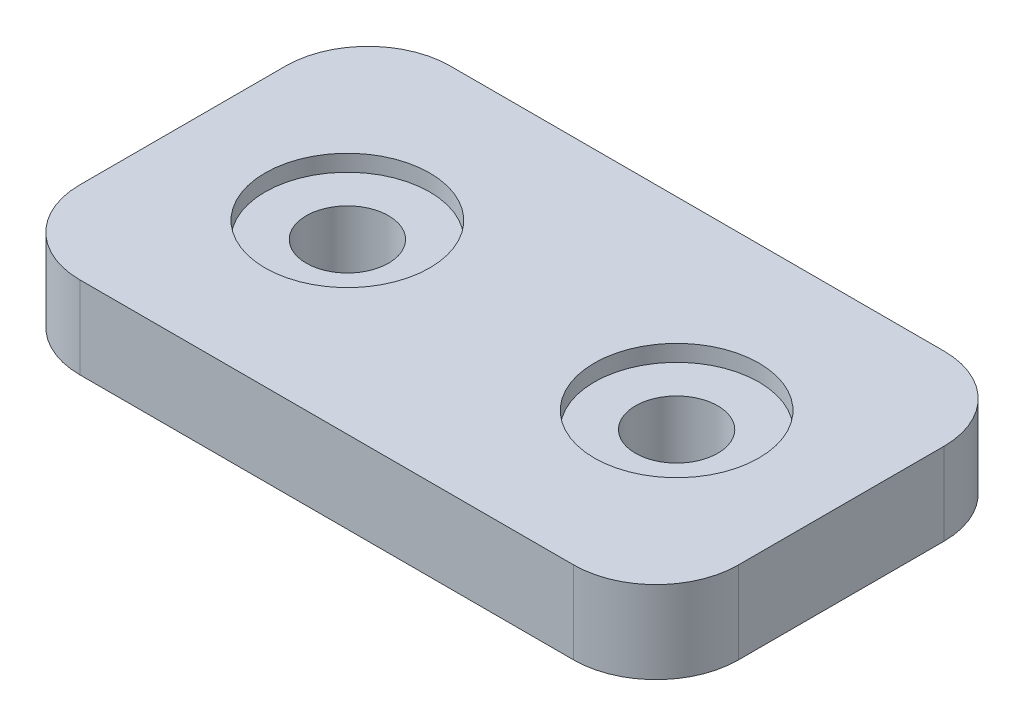
ISO-10303-21;
HEADER;
FILE_DESCRIPTION(('STEP AP214'),'2;1');
FILE_NAME('part.step','',(''),(''),'','','');
FILE_SCHEMA(('AUTOMOTIVE_DESIGN { 1 0 10303 214 1 1 1 1 }'));
ENDSEC;
DATA;
#1=APPLICATION_CONTEXT('core data for automotive mechanical design processes');
#2=APPLICATION_PROTOCOL_DEFINITION('international standard','automotive_design',2000,#1);
#3=PRODUCT_CONTEXT('',#1,'mechanical');
#4=PRODUCT('Part','Part','',(#3));
#5=PRODUCT_RELATED_PRODUCT_CATEGORY('part','',(#4));
#6=PRODUCT_DEFINITION_FORMATION('','',#4);
#7=PRODUCT_DEFINITION_CONTEXT('part definition',#1,'design');
#8=PRODUCT_DEFINITION('design','',#6,#7);
#9=PRODUCT_DEFINITION_SHAPE('','',#8);
#10=(LENGTH_UNIT() NAMED_UNIT(*) SI_UNIT(.MILLI.,.METRE.));
#11=(NAMED_UNIT(*) PLANE_ANGLE_UNIT() SI_UNIT($,.RADIAN.));
#12=(NAMED_UNIT(*) SI_UNIT($,.STERADIAN.) SOLID_ANGLE_UNIT());
#13=UNCERTAINTY_MEASURE_WITH_UNIT(LENGTH_MEASURE(1.E-05),#10,'distance_accuracy_value','');
#14=(GEOMETRIC_REPRESENTATION_CONTEXT(3) GLOBAL_UNCERTAINTY_ASSIGNED_CONTEXT((#13)) GLOBAL_UNIT_ASSIGNED_CONTEXT((#10,
#11,#12)) REPRESENTATION_CONTEXT('',''));
#15=CARTESIAN_POINT('',(0.,0.,0.));
#16=DIRECTION('',(0.,0.,1.));
#17=DIRECTION('',(1.,0.,0.));
#18=AXIS2_PLACEMENT_3D('',#15,#16,#17);
#19=CARTESIAN_POINT('',(0.,12.7,0.));
#20=DIRECTION('',(0.,1.,0.));
#21=DIRECTION('',(0.,0.,1.));
#22=AXIS2_PLACEMENT_3D('',#19,#20,#21);
#23=PLANE('',#22);
#24=DIRECTION('',(0.,0.,-1.));
#25=VECTOR('',#24,1.);
#26=CARTESIAN_POINT('',(50.8,12.7,28.575));
#27=LINE('',#26,#25);
#28=CARTESIAN_POINT('',(50.8,12.7,15.875));
#29=VERTEX_POINT('',#28);
#30=CARTESIAN_POINT('',(50.8,12.7,-15.875));
#31=VERTEX_POINT('',#30);
#32=EDGE_CURVE('E207',#29,#31,#27,.T.);
#33=ORIENTED_EDGE('',*,*,#32,.T.);
#34=CARTESIAN_POINT('',(38.1,12.7,-15.875));
#35=DIRECTION('',(0.,1.,0.));
#36=DIRECTION('',(0.,0.,1.));
#37=AXIS2_PLACEMENT_3D('',#34,#35,#36);
#38=CIRCLE('',#37,12.7);
#39=CARTESIAN_POINT('',(38.1,12.7,-28.575));
#40=VERTEX_POINT('',#39);
#41=EDGE_CURVE('E168',#31,#40,#38,.T.);
#42=ORIENTED_EDGE('',*,*,#41,.T.);
#43=DIRECTION('',(1.,0.,0.));
#44=VECTOR('',#43,1.);
#45=CARTESIAN_POINT('',(-50.8,12.7,-28.575));
#46=LINE('',#45,#44);
#47=CARTESIAN_POINT('',(-38.1,12.7,-28.575));
#48=VERTEX_POINT('',#47);
#49=EDGE_CURVE('E143',#48,#40,#46,.T.);
#50=ORIENTED_EDGE('',*,*,#49,.F.);
#51=CARTESIAN_POINT('',(-38.1,12.7,-15.875));
#52=DIRECTION('',(0.,1.,0.));
#53=DIRECTION('',(0.,0.,1.));
#54=AXIS2_PLACEMENT_3D('',#51,#52,#53);
#55=CIRCLE('',#54,12.7);
#56=CARTESIAN_POINT('',(-50.8,12.7,-15.875));
#57=VERTEX_POINT('',#56);
#58=EDGE_CURVE('E59',#48,#57,#55,.T.);
#59=ORIENTED_EDGE('',*,*,#58,.T.);
#60=DIRECTION('',(0.,0.,-1.));
#61=VECTOR('',#60,1.);
#62=CARTESIAN_POINT('',(-50.8,12.7,28.575));
#63=LINE('',#62,#61);
#64=CARTESIAN_POINT('',(-50.8,12.7,15.875));
#65=VERTEX_POINT('',#64);
#66=EDGE_CURVE('E135',#65,#57,#63,.T.);
#67=ORIENTED_EDGE('',*,*,#66,.F.);
#68=CARTESIAN_POINT('',(-38.1,12.7,15.875));
#69=DIRECTION('',(0.,1.,0.));
#70=DIRECTION('',(0.,0.,1.));
#71=AXIS2_PLACEMENT_3D('',#68,#69,#70);
#72=CIRCLE('',#71,12.7);
#73=CARTESIAN_POINT('',(-38.1,12.7,28.575));
#74=VERTEX_POINT('',#73);
#75=EDGE_CURVE('E160',#65,#74,#72,.T.);
#76=ORIENTED_EDGE('',*,*,#75,.T.);
#77=DIRECTION('',(1.,0.,0.));
#78=VECTOR('',#77,1.);
#79=CARTESIAN_POINT('',(-50.8,12.7,28.575));
#80=LINE('',#79,#78);
#81=CARTESIAN_POINT('',(38.1,12.7,28.575));
#82=VERTEX_POINT('',#81);
#83=EDGE_CURVE('E188',#74,#82,#80,.T.);
#84=ORIENTED_EDGE('',*,*,#83,.T.);
#85=CARTESIAN_POINT('',(38.1,12.7,15.875));
#86=DIRECTION('',(0.,1.,0.));
#87=DIRECTION('',(0.,0.,1.));
#88=AXIS2_PLACEMENT_3D('',#85,#86,#87);
#89=CIRCLE('',#88,12.7);
#90=EDGE_CURVE('E163',#82,#29,#89,.T.);
#91=ORIENTED_EDGE('',*,*,#90,.T.);
#92=EDGE_LOOP('',(#33,#42,#50,#59,#67,#76,#84,#91));
#93=FACE_BOUND('',#92,.T.);
#94=CARTESIAN_POINT('',(25.4,12.7,0.));
#95=DIRECTION('',(0.,1.,0.));
#96=DIRECTION('',(0.,0.,1.));
#97=AXIS2_PLACEMENT_3D('',#94,#95,#96);
#98=CIRCLE('',#97,12.7);
#99=CARTESIAN_POINT('',(25.4,12.7,12.7));
#100=VERTEX_POINT('',#99);
#101=EDGE_CURVE('E217',#100,#100,#98,.F.);
#102=ORIENTED_EDGE('',*,*,#101,.T.);
#103=EDGE_LOOP('',(#102));
#104=FACE_BOUND('',#103,.T.);
#105=CARTESIAN_POINT('',(-25.4,12.7,0.));
#106=DIRECTION('',(0.,1.,0.));
#107=DIRECTION('',(0.,0.,1.));
#108=AXIS2_PLACEMENT_3D('',#105,#106,#107);
#109=CIRCLE('',#108,12.7);
#110=CARTESIAN_POINT('',(-25.4,12.7,12.7));
#111=VERTEX_POINT('',#110);
#112=EDGE_CURVE('E226',#111,#111,#109,.T.);
#113=ORIENTED_EDGE('',*,*,#112,.F.);
#114=EDGE_LOOP('',(#113));
#115=FACE_BOUND('',#114,.T.);
#116=ADVANCED_FACE('F43',(#93,#104,#115),#23,.T.);
#117=CARTESIAN_POINT('',(25.4,0.,0.));
#118=DIRECTION('',(0.,1.,0.));
#119=DIRECTION('',(0.,0.,1.));
#120=AXIS2_PLACEMENT_3D('',#117,#118,#119);
#121=CYLINDRICAL_SURFACE('',#120,6.35);
#122=CARTESIAN_POINT('',(25.4,0.,0.));
#123=DIRECTION('',(0.,1.,0.));
#124=DIRECTION('',(0.,0.,1.));
#125=AXIS2_PLACEMENT_3D('',#122,#123,#124);
#126=CIRCLE('',#125,6.35);
#127=CARTESIAN_POINT('',(25.4,0.,6.35));
#128=VERTEX_POINT('',#127);
#129=EDGE_CURVE('E202',#128,#128,#126,.T.);
#130=ORIENTED_EDGE('',*,*,#129,.F.);
#131=EDGE_LOOP('',(#130));
#132=FACE_BOUND('',#131,.T.);
#133=CARTESIAN_POINT('',(25.4,10.16,0.));
#134=DIRECTION('',(0.,1.,0.));
#135=DIRECTION('',(0.,0.,1.));
#136=AXIS2_PLACEMENT_3D('',#133,#134,#135);
#137=CIRCLE('',#136,6.35);
#138=CARTESIAN_POINT('',(25.4,10.16,6.35));
#139=VERTEX_POINT('',#138);
#140=EDGE_CURVE('E221',#139,#139,#137,.T.);
#141=ORIENTED_EDGE('',*,*,#140,.T.);
#142=EDGE_LOOP('',(#141));
#143=FACE_BOUND('',#142,.T.);
#144=ADVANCED_FACE('F259',(#132,#143),#121,.F.);
#145=CARTESIAN_POINT('',(-25.4,0.,0.));
#146=DIRECTION('',(0.,1.,0.));
#147=DIRECTION('',(0.,0.,1.));
#148=AXIS2_PLACEMENT_3D('',#145,#146,#147);
#149=CYLINDRICAL_SURFACE('',#148,6.35);
#150=CARTESIAN_POINT('',(-25.4,0.,0.));
#151=DIRECTION('',(0.,1.,0.));
#152=DIRECTION('',(0.,0.,1.));
#153=AXIS2_PLACEMENT_3D('',#150,#151,#152);
#154=CIRCLE('',#153,6.35);
#155=CARTESIAN_POINT('',(-25.4,0.,6.34999999999999));
#156=VERTEX_POINT('',#155);
#157=EDGE_CURVE('E193',#156,#156,#154,.T.);
#158=ORIENTED_EDGE('',*,*,#157,.F.);
#159=EDGE_LOOP('',(#158));
#160=FACE_BOUND('',#159,.T.);
#161=CARTESIAN_POINT('',(-25.4,10.16,0.));
#162=DIRECTION('',(0.,1.,0.));
#163=DIRECTION('',(0.,0.,1.));
#164=AXIS2_PLACEMENT_3D('',#161,#162,#163);
#165=CIRCLE('',#164,6.35);
#166=CARTESIAN_POINT('',(-25.4,10.16,6.34999999999999));
#167=VERTEX_POINT('',#166);
#168=EDGE_CURVE('E233',#167,#167,#165,.T.);
#169=ORIENTED_EDGE('',*,*,#168,.T.);
#170=EDGE_LOOP('',(#169));
#171=FACE_BOUND('',#170,.T.);
#172=ADVANCED_FACE('F243',(#160,#171),#149,.F.);
#173=CARTESIAN_POINT('',(-50.8,12.7,28.575));
#174=DIRECTION('',(0.,0.,-1.));
#175=DIRECTION('',(-1.,0.,0.));
#176=AXIS2_PLACEMENT_3D('',#173,#174,#175);
#177=PLANE('',#176);
#178=DIRECTION('',(1.,0.,0.));
#179=VECTOR('',#178,1.);
#180=CARTESIAN_POINT('',(-50.8,0.,28.575));
#181=LINE('',#180,#179);
#182=CARTESIAN_POINT('',(-38.1,0.,28.575));
#183=VERTEX_POINT('',#182);
#184=CARTESIAN_POINT('',(38.1,0.,28.575));
#185=VERTEX_POINT('',#184);
#186=EDGE_CURVE('E185',#183,#185,#181,.T.);
#187=ORIENTED_EDGE('',*,*,#186,.T.);
#188=DIRECTION('',(0.,-1.,0.));
#189=VECTOR('',#188,1.);
#190=CARTESIAN_POINT('',(38.1,12.7,28.575));
#191=LINE('',#190,#189);
#192=EDGE_CURVE('E11',#185,#82,#191,.F.);
#193=ORIENTED_EDGE('',*,*,#192,.T.);
#194=ORIENTED_EDGE('',*,*,#83,.F.);
#195=DIRECTION('',(0.,-1.,0.));
#196=VECTOR('',#195,1.);
#197=CARTESIAN_POINT('',(-38.1,0.,28.575));
#198=LINE('',#197,#196);
#199=EDGE_CURVE('E52',#74,#183,#198,.T.);
#200=ORIENTED_EDGE('',*,*,#199,.T.);
#201=EDGE_LOOP('',(#187,#193,#194,#200));
#202=FACE_BOUND('',#201,.T.);
#203=ADVANCED_FACE('F184',(#202),#177,.F.);
#204=CARTESIAN_POINT('',(50.8,12.7,28.575));
#205=DIRECTION('',(-1.,0.,0.));
#206=DIRECTION('',(0.,0.,1.));
#207=AXIS2_PLACEMENT_3D('',#204,#205,#206);
#208=PLANE('',#207);
#209=DIRECTION('',(0.,0.,-1.));
#210=VECTOR('',#209,1.);
#211=CARTESIAN_POINT('',(50.8,0.,28.575));
#212=LINE('',#211,#210);
#213=CARTESIAN_POINT('',(50.8,0.,15.875));
#214=VERTEX_POINT('',#213);
#215=CARTESIAN_POINT('',(50.8,0.,-15.875));
#216=VERTEX_POINT('',#215);
#217=EDGE_CURVE('E131',#214,#216,#212,.T.);
#218=ORIENTED_EDGE('',*,*,#217,.T.);
#219=DIRECTION('',(0.,-1.,0.));
#220=VECTOR('',#219,1.);
#221=CARTESIAN_POINT('',(50.8,12.7,-15.875));
#222=LINE('',#221,#220);
#223=EDGE_CURVE('E157',#216,#31,#222,.F.);
#224=ORIENTED_EDGE('',*,*,#223,.T.);
#225=ORIENTED_EDGE('',*,*,#32,.F.);
#226=DIRECTION('',(0.,-1.,0.));
#227=VECTOR('',#226,1.);
#228=CARTESIAN_POINT('',(50.8,12.7,15.875));
#229=LINE('',#228,#227);
#230=EDGE_CURVE('E153',#29,#214,#229,.T.);
#231=ORIENTED_EDGE('',*,*,#230,.T.);
#232=EDGE_LOOP('',(#218,#224,#225,#231));
#233=FACE_BOUND('',#232,.T.);
#234=ADVANCED_FACE('F277',(#233),#208,.F.);
#235=CARTESIAN_POINT('',(-50.8,12.7,-28.575));
#236=DIRECTION('',(0.,0.,-1.));
#237=DIRECTION('',(-1.,0.,0.));
#238=AXIS2_PLACEMENT_3D('',#235,#236,#237);
#239=PLANE('',#238);
#240=ORIENTED_EDGE('',*,*,#49,.T.);
#241=DIRECTION('',(0.,-1.,0.));
#242=VECTOR('',#241,1.);
#243=CARTESIAN_POINT('',(38.1,0.,-28.575));
#244=LINE('',#243,#242);
#245=CARTESIAN_POINT('',(38.1,0.,-28.575));
#246=VERTEX_POINT('',#245);
#247=EDGE_CURVE('E129',#40,#246,#244,.T.);
#248=ORIENTED_EDGE('',*,*,#247,.T.);
#249=DIRECTION('',(1.,0.,0.));
#250=VECTOR('',#249,1.);
#251=CARTESIAN_POINT('',(-50.8,0.,-28.575));
#252=LINE('',#251,#250);
#253=CARTESIAN_POINT('',(-38.1,0.,-28.575));
#254=VERTEX_POINT('',#253);
#255=EDGE_CURVE('E113',#254,#246,#252,.T.);
#256=ORIENTED_EDGE('',*,*,#255,.F.);
#257=DIRECTION('',(0.,-1.,0.));
#258=VECTOR('',#257,1.);
#259=CARTESIAN_POINT('',(-38.1,12.7,-28.575));
#260=LINE('',#259,#258);
#261=EDGE_CURVE('E127',#254,#48,#260,.F.);
#262=ORIENTED_EDGE('',*,*,#261,.T.);
#263=EDGE_LOOP('',(#240,#248,#256,#262));
#264=FACE_BOUND('',#263,.T.);
#265=ADVANCED_FACE('F126',(#264),#239,.T.);
#266=CARTESIAN_POINT('',(-50.8,12.7,28.575));
#267=DIRECTION('',(-1.,0.,0.));
#268=DIRECTION('',(0.,0.,1.));
#269=AXIS2_PLACEMENT_3D('',#266,#267,#268);
#270=PLANE('',#269);
#271=ORIENTED_EDGE('',*,*,#66,.T.);
#272=DIRECTION('',(0.,-1.,0.));
#273=VECTOR('',#272,1.);
#274=CARTESIAN_POINT('',(-50.8,12.7,-15.875));
#275=LINE('',#274,#273);
#276=CARTESIAN_POINT('',(-50.8,0.,-15.875));
#277=VERTEX_POINT('',#276);
#278=EDGE_CURVE('E173',#57,#277,#275,.T.);
#279=ORIENTED_EDGE('',*,*,#278,.T.);
#280=DIRECTION('',(0.,0.,-1.));
#281=VECTOR('',#280,1.);
#282=CARTESIAN_POINT('',(-50.8,0.,28.575));
#283=LINE('',#282,#281);
#284=CARTESIAN_POINT('',(-50.8,0.,15.875));
#285=VERTEX_POINT('',#284);
#286=EDGE_CURVE('E114',#285,#277,#283,.T.);
#287=ORIENTED_EDGE('',*,*,#286,.F.);
#288=DIRECTION('',(0.,-1.,0.));
#289=VECTOR('',#288,1.);
#290=CARTESIAN_POINT('',(-50.8,12.7,15.875));
#291=LINE('',#290,#289);
#292=EDGE_CURVE('E66',#285,#65,#291,.F.);
#293=ORIENTED_EDGE('',*,*,#292,.T.);
#294=EDGE_LOOP('',(#271,#279,#287,#293));
#295=FACE_BOUND('',#294,.T.);
#296=ADVANCED_FACE('F271',(#295),#270,.T.);
#297=CARTESIAN_POINT('',(0.,0.,0.));
#298=DIRECTION('',(0.,1.,0.));
#299=DIRECTION('',(0.,0.,1.));
#300=AXIS2_PLACEMENT_3D('',#297,#298,#299);
#301=PLANE('',#300);
#302=ORIENTED_EDGE('',*,*,#157,.T.);
#303=EDGE_LOOP('',(#302));
#304=FACE_BOUND('',#303,.T.);
#305=ORIENTED_EDGE('',*,*,#129,.T.);
#306=EDGE_LOOP('',(#305));
#307=FACE_BOUND('',#306,.T.);
#308=ORIENTED_EDGE('',*,*,#255,.T.);
#309=CARTESIAN_POINT('',(38.1,0.,-15.875));
#310=DIRECTION('',(0.,1.,0.));
#311=DIRECTION('',(0.,0.,1.));
#312=AXIS2_PLACEMENT_3D('',#309,#310,#311);
#313=CIRCLE('',#312,12.7);
#314=EDGE_CURVE('E120',#246,#216,#313,.F.);
#315=ORIENTED_EDGE('',*,*,#314,.T.);
#316=ORIENTED_EDGE('',*,*,#217,.F.);
#317=CARTESIAN_POINT('',(38.1,0.,15.875));
#318=DIRECTION('',(0.,1.,0.));
#319=DIRECTION('',(0.,0.,1.));
#320=AXIS2_PLACEMENT_3D('',#317,#318,#319);
#321=CIRCLE('',#320,12.7);
#322=EDGE_CURVE('E121',#214,#185,#321,.F.);
#323=ORIENTED_EDGE('',*,*,#322,.T.);
#324=ORIENTED_EDGE('',*,*,#186,.F.);
#325=CARTESIAN_POINT('',(-38.1,0.,15.875));
#326=DIRECTION('',(0.,1.,0.));
#327=DIRECTION('',(0.,0.,1.));
#328=AXIS2_PLACEMENT_3D('',#325,#326,#327);
#329=CIRCLE('',#328,12.7);
#330=EDGE_CURVE('E141',#183,#285,#329,.F.);
#331=ORIENTED_EDGE('',*,*,#330,.T.);
#332=ORIENTED_EDGE('',*,*,#286,.T.);
#333=CARTESIAN_POINT('',(-38.1,0.,-15.875));
#334=DIRECTION('',(0.,1.,0.));
#335=DIRECTION('',(0.,0.,1.));
#336=AXIS2_PLACEMENT_3D('',#333,#334,#335);
#337=CIRCLE('',#336,12.7);
#338=EDGE_CURVE('E110',#277,#254,#337,.F.);
#339=ORIENTED_EDGE('',*,*,#338,.T.);
#340=EDGE_LOOP('',(#308,#315,#316,#323,#324,#331,#332,#339));
#341=FACE_BOUND('',#340,.T.);
#342=ADVANCED_FACE('F112',(#304,#307,#341),#301,.F.);
#343=CARTESIAN_POINT('',(-25.4,10.16,0.));
#344=DIRECTION('',(0.,1.,0.));
#345=DIRECTION('',(0.,0.,1.));
#346=AXIS2_PLACEMENT_3D('',#343,#344,#345);
#347=CYLINDRICAL_SURFACE('',#346,12.7);
#348=CARTESIAN_POINT('',(-25.4,10.16,0.));
#349=DIRECTION('',(0.,1.,0.));
#350=DIRECTION('',(0.,0.,1.));
#351=AXIS2_PLACEMENT_3D('',#348,#349,#350);
#352=CIRCLE('',#351,12.7);
#353=CARTESIAN_POINT('',(-25.4,10.16,12.7));
#354=VERTEX_POINT('',#353);
#355=EDGE_CURVE('E215',#354,#354,#352,.T.);
#356=ORIENTED_EDGE('',*,*,#355,.F.);
#357=EDGE_LOOP('',(#356));
#358=FACE_BOUND('',#357,.T.);
#359=ORIENTED_EDGE('',*,*,#112,.T.);
#360=EDGE_LOOP('',(#359));
#361=FACE_BOUND('',#360,.T.);
#362=ADVANCED_FACE('F249',(#358,#361),#347,.F.);
#363=CARTESIAN_POINT('',(0.,10.16,0.));
#364=DIRECTION('',(0.,1.,0.));
#365=DIRECTION('',(0.,0.,1.));
#366=AXIS2_PLACEMENT_3D('',#363,#364,#365);
#367=PLANE('',#366);
#368=ORIENTED_EDGE('',*,*,#168,.F.);
#369=EDGE_LOOP('',(#368));
#370=FACE_BOUND('',#369,.T.);
#371=ORIENTED_EDGE('',*,*,#355,.T.);
#372=EDGE_LOOP('',(#371));
#373=FACE_BOUND('',#372,.T.);
#374=ADVANCED_FACE('F245',(#370,#373),#367,.T.);
#375=CARTESIAN_POINT('',(25.4,10.16,0.));
#376=DIRECTION('',(0.,1.,0.));
#377=DIRECTION('',(0.,0.,1.));
#378=AXIS2_PLACEMENT_3D('',#375,#376,#377);
#379=CYLINDRICAL_SURFACE('',#378,12.7);
#380=CARTESIAN_POINT('',(25.4,10.16,0.));
#381=DIRECTION('',(0.,1.,0.));
#382=DIRECTION('',(0.,0.,1.));
#383=AXIS2_PLACEMENT_3D('',#380,#381,#382);
#384=CIRCLE('',#383,12.7);
#385=CARTESIAN_POINT('',(25.4,10.16,12.7));
#386=VERTEX_POINT('',#385);
#387=EDGE_CURVE('E222',#386,#386,#384,.F.);
#388=ORIENTED_EDGE('',*,*,#387,.T.);
#389=EDGE_LOOP('',(#388));
#390=FACE_BOUND('',#389,.T.);
#391=ORIENTED_EDGE('',*,*,#101,.F.);
#392=EDGE_LOOP('',(#391));
#393=FACE_BOUND('',#392,.T.);
#394=ADVANCED_FACE('F248',(#390,#393),#379,.F.);
#395=CARTESIAN_POINT('',(0.,10.16,0.));
#396=DIRECTION('',(0.,1.,0.));
#397=DIRECTION('',(0.,0.,1.));
#398=AXIS2_PLACEMENT_3D('',#395,#396,#397);
#399=PLANE('',#398);
#400=ORIENTED_EDGE('',*,*,#140,.F.);
#401=EDGE_LOOP('',(#400));
#402=FACE_BOUND('',#401,.T.);
#403=ORIENTED_EDGE('',*,*,#387,.F.);
#404=EDGE_LOOP('',(#403));
#405=FACE_BOUND('',#404,.T.);
#406=ADVANCED_FACE('F286',(#402,#405),#399,.T.);
#407=CARTESIAN_POINT('',(38.1,12.7,-15.875));
#408=DIRECTION('',(0.,1.,0.));
#409=DIRECTION('',(0.,0.,1.));
#410=AXIS2_PLACEMENT_3D('',#407,#408,#409);
#411=CYLINDRICAL_SURFACE('',#410,12.7);
#412=ORIENTED_EDGE('',*,*,#41,.F.);
#413=ORIENTED_EDGE('',*,*,#223,.F.);
#414=ORIENTED_EDGE('',*,*,#314,.F.);
#415=ORIENTED_EDGE('',*,*,#247,.F.);
#416=EDGE_LOOP('',(#412,#413,#414,#415));
#417=FACE_BOUND('',#416,.T.);
#418=ADVANCED_FACE('F283',(#417),#411,.T.);
#419=CARTESIAN_POINT('',(-38.1,12.7,-15.875));
#420=DIRECTION('',(0.,-1.,0.));
#421=DIRECTION('',(0.,0.,-1.));
#422=AXIS2_PLACEMENT_3D('',#419,#420,#421);
#423=CYLINDRICAL_SURFACE('',#422,12.7);
#424=ORIENTED_EDGE('',*,*,#58,.F.);
#425=ORIENTED_EDGE('',*,*,#261,.F.);
#426=ORIENTED_EDGE('',*,*,#338,.F.);
#427=ORIENTED_EDGE('',*,*,#278,.F.);
#428=EDGE_LOOP('',(#424,#425,#426,#427));
#429=FACE_BOUND('',#428,.T.);
#430=ADVANCED_FACE('F133',(#429),#423,.T.);
#431=CARTESIAN_POINT('',(38.1,12.7,15.875));
#432=DIRECTION('',(0.,-1.,0.));
#433=DIRECTION('',(0.,0.,-1.));
#434=AXIS2_PLACEMENT_3D('',#431,#432,#433);
#435=CYLINDRICAL_SURFACE('',#434,12.7);
#436=ORIENTED_EDGE('',*,*,#90,.F.);
#437=ORIENTED_EDGE('',*,*,#192,.F.);
#438=ORIENTED_EDGE('',*,*,#322,.F.);
#439=ORIENTED_EDGE('',*,*,#230,.F.);
#440=EDGE_LOOP('',(#436,#437,#438,#439));
#441=FACE_BOUND('',#440,.T.);
#442=ADVANCED_FACE('F289',(#441),#435,.T.);
#443=CARTESIAN_POINT('',(-38.1,12.7,15.875));
#444=DIRECTION('',(0.,1.,0.));
#445=DIRECTION('',(0.,0.,1.));
#446=AXIS2_PLACEMENT_3D('',#443,#444,#445);
#447=CYLINDRICAL_SURFACE('',#446,12.7);
#448=ORIENTED_EDGE('',*,*,#75,.F.);
#449=ORIENTED_EDGE('',*,*,#292,.F.);
#450=ORIENTED_EDGE('',*,*,#330,.F.);
#451=ORIENTED_EDGE('',*,*,#199,.F.);
#452=EDGE_LOOP('',(#448,#449,#450,#451));
#453=FACE_BOUND('',#452,.T.);
#454=ADVANCED_FACE('F45',(#453),#447,.T.);
#455=CLOSED_SHELL('',(#116,#144,#172,#203,#234,#265,#296,#342,#362,#374,#394,#406,#418,#430,
#442,#454));
#456=MANIFOLD_SOLID_BREP('B2',#455);
#457=ADVANCED_BREP_SHAPE_REPRESENTATION('',(#18,#456),#14);
#458=SHAPE_DEFINITION_REPRESENTATION(#9,#457);
ENDSEC;
END-ISO-10303-21;
